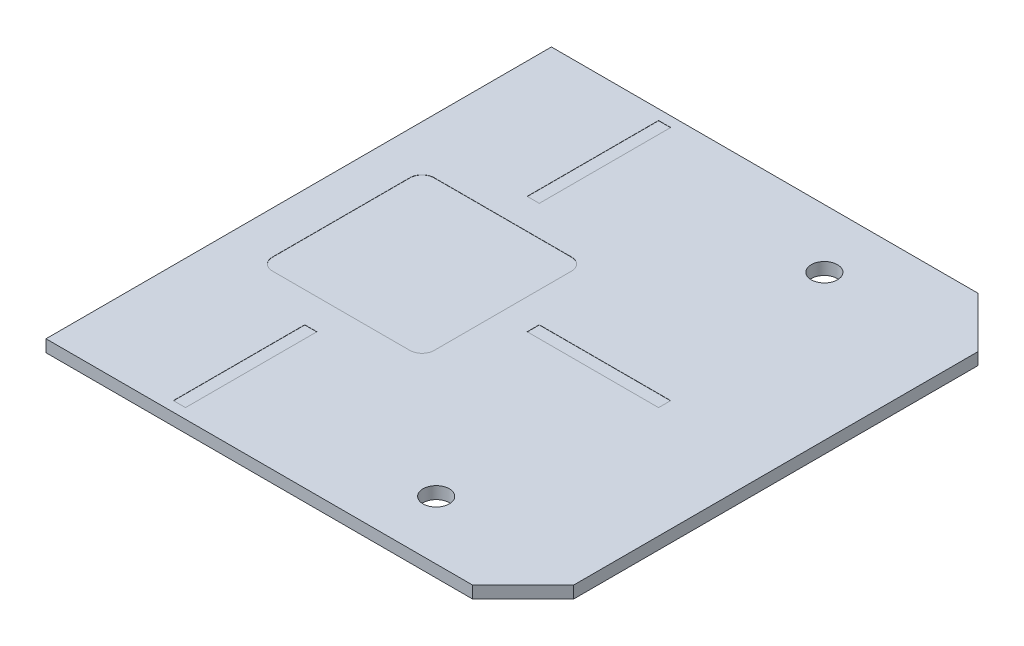
ISO-10303-21;
HEADER;
FILE_DESCRIPTION(('STEP AP214'),'2;1');
FILE_NAME('part.step','',(''),(''),'','','');
FILE_SCHEMA(('AUTOMOTIVE_DESIGN { 1 0 10303 214 1 1 1 1 }'));
ENDSEC;
DATA;
#1=APPLICATION_CONTEXT('core data for automotive mechanical design processes');
#2=APPLICATION_PROTOCOL_DEFINITION('international standard','automotive_design',2000,#1);
#3=PRODUCT_CONTEXT('',#1,'mechanical');
#4=PRODUCT('Part','Part','',(#3));
#5=PRODUCT_RELATED_PRODUCT_CATEGORY('part','',(#4));
#6=PRODUCT_DEFINITION_FORMATION('','',#4);
#7=PRODUCT_DEFINITION_CONTEXT('part definition',#1,'design');
#8=PRODUCT_DEFINITION('design','',#6,#7);
#9=PRODUCT_DEFINITION_SHAPE('','',#8);
#10=(LENGTH_UNIT() NAMED_UNIT(*) SI_UNIT(.MILLI.,.METRE.));
#11=(NAMED_UNIT(*) PLANE_ANGLE_UNIT() SI_UNIT($,.RADIAN.));
#12=(NAMED_UNIT(*) SI_UNIT($,.STERADIAN.) SOLID_ANGLE_UNIT());
#13=UNCERTAINTY_MEASURE_WITH_UNIT(LENGTH_MEASURE(1.E-05),#10,'distance_accuracy_value','');
#14=(GEOMETRIC_REPRESENTATION_CONTEXT(3) GLOBAL_UNCERTAINTY_ASSIGNED_CONTEXT((#13)) GLOBAL_UNIT_ASSIGNED_CONTEXT((#10,
#11,#12)) REPRESENTATION_CONTEXT('',''));
#15=CARTESIAN_POINT('',(0.,0.,0.));
#16=DIRECTION('',(0.,0.,1.));
#17=DIRECTION('',(1.,0.,0.));
#18=AXIS2_PLACEMENT_3D('',#15,#16,#17);
#19=CARTESIAN_POINT('',(0.,-4.30000000000049,0.));
#20=DIRECTION('',(0.,-1.,0.));
#21=DIRECTION('',(1.,0.,0.));
#22=AXIS2_PLACEMENT_3D('',#19,#20,#21);
#23=PLANE('',#22);
#24=CARTESIAN_POINT('',(849.000000000043,-4.3000000000004,96.));
#25=DIRECTION('',(0.,-1.,0.));
#26=DIRECTION('',(1.,0.,0.));
#27=AXIS2_PLACEMENT_3D('',#24,#25,#26);
#28=CIRCLE('',#27,6.50000000000002);
#29=CARTESIAN_POINT('',(855.500000000043,-4.3000000000004,96.));
#30=VERTEX_POINT('',#29);
#31=EDGE_CURVE('E399',#30,#30,#28,.T.);
#32=ORIENTED_EDGE('',*,*,#31,.F.);
#33=EDGE_LOOP('',(#32));
#34=FACE_BOUND('',#33,.T.);
#35=DIRECTION('',(1.,0.,0.));
#36=VECTOR('',#35,1.);
#37=CARTESIAN_POINT('',(896.000000000044,-4.3000000000004,-125.));
#38=LINE('',#37,#36);
#39=CARTESIAN_POINT('',(685.000000000044,-4.30000000000042,-125.000000000003));
#40=VERTEX_POINT('',#39);
#41=CARTESIAN_POINT('',(896.000000000044,-4.3000000000004,-125.));
#42=VERTEX_POINT('',#41);
#43=EDGE_CURVE('E405',#40,#42,#38,.T.);
#44=ORIENTED_EDGE('',*,*,#43,.T.);
#45=DIRECTION('',(0.707106781186538,0.,0.707106781186557));
#46=VECTOR('',#45,1.);
#47=CARTESIAN_POINT('',(921.000000000044,-4.3000000000004,-100.));
#48=LINE('',#47,#46);
#49=CARTESIAN_POINT('',(921.000000000044,-4.3000000000004,-100.));
#50=VERTEX_POINT('',#49);
#51=EDGE_CURVE('E408',#42,#50,#48,.T.);
#52=ORIENTED_EDGE('',*,*,#51,.T.);
#53=DIRECTION('',(0.,0.,1.));
#54=VECTOR('',#53,1.);
#55=CARTESIAN_POINT('',(921.000000000044,-4.3000000000004,-100.));
#56=LINE('',#55,#54);
#57=CARTESIAN_POINT('',(921.000000000043,-4.3000000000004,100.));
#58=VERTEX_POINT('',#57);
#59=EDGE_CURVE('E411',#50,#58,#56,.T.);
#60=ORIENTED_EDGE('',*,*,#59,.T.);
#61=DIRECTION('',(-0.707106781186549,0.,0.707106781186546));
#62=VECTOR('',#61,1.);
#63=CARTESIAN_POINT('',(921.000000000043,-4.3000000000004,100.));
#64=LINE('',#63,#62);
#65=CARTESIAN_POINT('',(896.000000000042,-4.3000000000004,125.));
#66=VERTEX_POINT('',#65);
#67=EDGE_CURVE('E413',#58,#66,#64,.T.);
#68=ORIENTED_EDGE('',*,*,#67,.T.);
#69=DIRECTION('',(-1.,0.,0.));
#70=VECTOR('',#69,1.);
#71=CARTESIAN_POINT('',(896.000000000042,-4.3000000000004,125.));
#72=LINE('',#71,#70);
#73=CARTESIAN_POINT('',(685.000000000043,-4.30000000000042,125.));
#74=VERTEX_POINT('',#73);
#75=EDGE_CURVE('E415',#66,#74,#72,.T.);
#76=ORIENTED_EDGE('',*,*,#75,.T.);
#77=DIRECTION('',(0.,0.,-1.));
#78=VECTOR('',#77,1.);
#79=CARTESIAN_POINT('',(685.000000000043,-4.30000000000042,125.));
#80=LINE('',#79,#78);
#81=EDGE_CURVE('E417',#74,#40,#80,.T.);
#82=ORIENTED_EDGE('',*,*,#81,.T.);
#83=EDGE_LOOP('',(#44,#52,#60,#68,#76,#82));
#84=FACE_BOUND('',#83,.T.);
#85=CARTESIAN_POINT('',(849.000000000044,-4.3000000000004,-96.000000000001));
#86=DIRECTION('',(0.,-1.,0.));
#87=DIRECTION('',(-1.,0.,0.));
#88=AXIS2_PLACEMENT_3D('',#85,#86,#87);
#89=CIRCLE('',#88,6.5);
#90=CARTESIAN_POINT('',(842.500000000044,-4.3000000000004,-96.000000000001));
#91=VERTEX_POINT('',#90);
#92=EDGE_CURVE('E393',#91,#91,#89,.T.);
#93=ORIENTED_EDGE('',*,*,#92,.F.);
#94=EDGE_LOOP('',(#93));
#95=FACE_BOUND('',#94,.T.);
#96=ADVANCED_FACE('F55',(#34,#84,#95),#23,.T.);
#97=CARTESIAN_POINT('',(0.,1.69999999999951,0.));
#98=DIRECTION('',(0.,-1.,0.));
#99=DIRECTION('',(1.,0.,0.));
#100=AXIS2_PLACEMENT_3D('',#97,#98,#99);
#101=PLANE('',#100);
#102=DIRECTION('',(-1.,0.,0.));
#103=VECTOR('',#102,1.);
#104=CARTESIAN_POINT('',(712.,1.69999999999958,-40.));
#105=LINE('',#104,#103);
#106=CARTESIAN_POINT('',(780.,1.69999999999959,-40.));
#107=VERTEX_POINT('',#106);
#108=CARTESIAN_POINT('',(712.,1.69999999999958,-40.));
#109=VERTEX_POINT('',#108);
#110=EDGE_CURVE('E269',#107,#109,#105,.T.);
#111=ORIENTED_EDGE('',*,*,#110,.F.);
#112=CARTESIAN_POINT('',(780.,1.69999999999959,-34.));
#113=DIRECTION('',(0.,1.,0.));
#114=DIRECTION('',(1.,0.,0.));
#115=AXIS2_PLACEMENT_3D('',#112,#113,#114);
#116=CIRCLE('',#115,6.);
#117=CARTESIAN_POINT('',(786.,1.69999999999959,-34.));
#118=VERTEX_POINT('',#117);
#119=EDGE_CURVE('E70',#118,#107,#116,.T.);
#120=ORIENTED_EDGE('',*,*,#119,.F.);
#121=DIRECTION('',(0.,0.,-1.));
#122=VECTOR('',#121,1.);
#123=CARTESIAN_POINT('',(786.,1.69999999999959,-34.));
#124=LINE('',#123,#122);
#125=CARTESIAN_POINT('',(786.,1.69999999999959,34.0000000000001));
#126=VERTEX_POINT('',#125);
#127=EDGE_CURVE('E249',#126,#118,#124,.T.);
#128=ORIENTED_EDGE('',*,*,#127,.F.);
#129=CARTESIAN_POINT('',(780.,1.69999999999959,34.0000000000002));
#130=DIRECTION('',(0.,1.,0.));
#131=DIRECTION('',(-1.,0.,0.));
#132=AXIS2_PLACEMENT_3D('',#129,#130,#131);
#133=CIRCLE('',#132,6.);
#134=CARTESIAN_POINT('',(780.,1.69999999999959,40.0000000000002));
#135=VERTEX_POINT('',#134);
#136=EDGE_CURVE('E252',#135,#126,#133,.T.);
#137=ORIENTED_EDGE('',*,*,#136,.F.);
#138=DIRECTION('',(1.,0.,0.));
#139=VECTOR('',#138,1.);
#140=CARTESIAN_POINT('',(712.,1.69999999999958,40.0000000000002));
#141=LINE('',#140,#139);
#142=CARTESIAN_POINT('',(712.,1.69999999999958,40.0000000000002));
#143=VERTEX_POINT('',#142);
#144=EDGE_CURVE('E280',#143,#135,#141,.T.);
#145=ORIENTED_EDGE('',*,*,#144,.F.);
#146=CARTESIAN_POINT('',(712.,1.69999999999958,34.0000000000002));
#147=DIRECTION('',(0.,1.,0.));
#148=DIRECTION('',(-1.,0.,0.));
#149=AXIS2_PLACEMENT_3D('',#146,#147,#148);
#150=CIRCLE('',#149,6.);
#151=CARTESIAN_POINT('',(706.,1.69999999999958,34.0000000000001));
#152=VERTEX_POINT('',#151);
#153=EDGE_CURVE('E277',#152,#143,#150,.T.);
#154=ORIENTED_EDGE('',*,*,#153,.F.);
#155=DIRECTION('',(0.,0.,1.));
#156=VECTOR('',#155,1.);
#157=CARTESIAN_POINT('',(706.,1.69999999999958,-34.));
#158=LINE('',#157,#156);
#159=CARTESIAN_POINT('',(706.,1.69999999999958,-34.));
#160=VERTEX_POINT('',#159);
#161=EDGE_CURVE('E274',#160,#152,#158,.T.);
#162=ORIENTED_EDGE('',*,*,#161,.F.);
#163=CARTESIAN_POINT('',(712.,1.69999999999958,-34.));
#164=DIRECTION('',(0.,1.,0.));
#165=DIRECTION('',(-1.,0.,0.));
#166=AXIS2_PLACEMENT_3D('',#163,#164,#165);
#167=CIRCLE('',#166,6.);
#168=EDGE_CURVE('E271',#109,#160,#167,.T.);
#169=ORIENTED_EDGE('',*,*,#168,.F.);
#170=EDGE_LOOP('',(#111,#120,#128,#137,#145,#154,#162,#169));
#171=FACE_BOUND('',#170,.T.);
#172=DIRECTION('',(1.,0.,0.));
#173=VECTOR('',#172,1.);
#174=CARTESIAN_POINT('',(743.,1.69999999999959,120.));
#175=LINE('',#174,#173);
#176=CARTESIAN_POINT('',(743.,1.69999999999959,120.));
#177=VERTEX_POINT('',#176);
#178=CARTESIAN_POINT('',(749.,1.69999999999959,120.));
#179=VERTEX_POINT('',#178);
#180=EDGE_CURVE('E313',#177,#179,#175,.T.);
#181=ORIENTED_EDGE('',*,*,#180,.F.);
#182=DIRECTION('',(0.,0.,1.));
#183=VECTOR('',#182,1.);
#184=CARTESIAN_POINT('',(743.,1.69999999999959,55.));
#185=LINE('',#184,#183);
#186=CARTESIAN_POINT('',(743.,1.69999999999959,55.));
#187=VERTEX_POINT('',#186);
#188=EDGE_CURVE('E78',#187,#177,#185,.T.);
#189=ORIENTED_EDGE('',*,*,#188,.F.);
#190=DIRECTION('',(-1.,0.,0.));
#191=VECTOR('',#190,1.);
#192=CARTESIAN_POINT('',(743.,1.69999999999959,55.));
#193=LINE('',#192,#191);
#194=CARTESIAN_POINT('',(749.,1.69999999999959,55.));
#195=VERTEX_POINT('',#194);
#196=EDGE_CURVE('E302',#195,#187,#193,.T.);
#197=ORIENTED_EDGE('',*,*,#196,.F.);
#198=DIRECTION('',(0.,0.,-1.));
#199=VECTOR('',#198,1.);
#200=CARTESIAN_POINT('',(749.,1.69999999999959,55.));
#201=LINE('',#200,#199);
#202=EDGE_CURVE('E316',#179,#195,#201,.T.);
#203=ORIENTED_EDGE('',*,*,#202,.F.);
#204=EDGE_LOOP('',(#181,#189,#197,#203));
#205=FACE_BOUND('',#204,.T.);
#206=DIRECTION('',(1.,0.,0.));
#207=VECTOR('',#206,1.);
#208=CARTESIAN_POINT('',(801.,1.69999999999959,3.));
#209=LINE('',#208,#207);
#210=CARTESIAN_POINT('',(801.,1.69999999999959,3.));
#211=VERTEX_POINT('',#210);
#212=CARTESIAN_POINT('',(866.,1.6999999999996,3.));
#213=VERTEX_POINT('',#212);
#214=EDGE_CURVE('E344',#211,#213,#209,.T.);
#215=ORIENTED_EDGE('',*,*,#214,.F.);
#216=DIRECTION('',(0.,0.,1.));
#217=VECTOR('',#216,1.);
#218=CARTESIAN_POINT('',(801.,1.69999999999959,-3.));
#219=LINE('',#218,#217);
#220=CARTESIAN_POINT('',(801.,1.69999999999959,-3.));
#221=VERTEX_POINT('',#220);
#222=EDGE_CURVE('E323',#221,#211,#219,.T.);
#223=ORIENTED_EDGE('',*,*,#222,.F.);
#224=DIRECTION('',(-1.,0.,0.));
#225=VECTOR('',#224,1.);
#226=CARTESIAN_POINT('',(801.,1.69999999999959,-3.));
#227=LINE('',#226,#225);
#228=CARTESIAN_POINT('',(866.,1.6999999999996,-3.));
#229=VERTEX_POINT('',#228);
#230=EDGE_CURVE('E333',#229,#221,#227,.T.);
#231=ORIENTED_EDGE('',*,*,#230,.F.);
#232=DIRECTION('',(0.,0.,-1.));
#233=VECTOR('',#232,1.);
#234=CARTESIAN_POINT('',(866.,1.6999999999996,-3.));
#235=LINE('',#234,#233);
#236=EDGE_CURVE('E347',#213,#229,#235,.T.);
#237=ORIENTED_EDGE('',*,*,#236,.F.);
#238=EDGE_LOOP('',(#215,#223,#231,#237));
#239=FACE_BOUND('',#238,.T.);
#240=DIRECTION('',(1.,0.,0.));
#241=VECTOR('',#240,1.);
#242=CARTESIAN_POINT('',(743.000000000002,1.69999999999959,-55.));
#243=LINE('',#242,#241);
#244=CARTESIAN_POINT('',(743.000000000002,1.69999999999959,-55.));
#245=VERTEX_POINT('',#244);
#246=CARTESIAN_POINT('',(749.000000000001,1.69999999999959,-55.));
#247=VERTEX_POINT('',#246);
#248=EDGE_CURVE('E376',#245,#247,#243,.T.);
#249=ORIENTED_EDGE('',*,*,#248,.F.);
#250=DIRECTION('',(0.,0.,1.));
#251=VECTOR('',#250,1.);
#252=CARTESIAN_POINT('',(743.000000000002,1.69999999999959,-120.));
#253=LINE('',#252,#251);
#254=CARTESIAN_POINT('',(743.000000000002,1.69999999999959,-120.));
#255=VERTEX_POINT('',#254);
#256=EDGE_CURVE('E354',#255,#245,#253,.T.);
#257=ORIENTED_EDGE('',*,*,#256,.F.);
#258=DIRECTION('',(-1.,0.,0.));
#259=VECTOR('',#258,1.);
#260=CARTESIAN_POINT('',(743.000000000002,1.69999999999959,-120.));
#261=LINE('',#260,#259);
#262=CARTESIAN_POINT('',(749.000000000001,1.69999999999959,-120.));
#263=VERTEX_POINT('',#262);
#264=EDGE_CURVE('E365',#263,#255,#261,.T.);
#265=ORIENTED_EDGE('',*,*,#264,.F.);
#266=DIRECTION('',(0.,0.,-1.));
#267=VECTOR('',#266,1.);
#268=CARTESIAN_POINT('',(749.000000000001,1.69999999999959,-120.));
#269=LINE('',#268,#267);
#270=EDGE_CURVE('E379',#247,#263,#269,.T.);
#271=ORIENTED_EDGE('',*,*,#270,.F.);
#272=EDGE_LOOP('',(#249,#257,#265,#271));
#273=FACE_BOUND('',#272,.T.);
#274=DIRECTION('',(1.,0.,0.));
#275=VECTOR('',#274,1.);
#276=CARTESIAN_POINT('',(896.000000000044,1.6999999999996,-125.));
#277=LINE('',#276,#275);
#278=CARTESIAN_POINT('',(685.000000000044,1.69999999999958,-125.000000000003));
#279=VERTEX_POINT('',#278);
#280=CARTESIAN_POINT('',(896.000000000044,1.6999999999996,-125.));
#281=VERTEX_POINT('',#280);
#282=EDGE_CURVE('E402',#279,#281,#277,.T.);
#283=ORIENTED_EDGE('',*,*,#282,.F.);
#284=DIRECTION('',(0.,0.,-1.));
#285=VECTOR('',#284,1.);
#286=CARTESIAN_POINT('',(685.000000000043,1.69999999999958,125.));
#287=LINE('',#286,#285);
#288=CARTESIAN_POINT('',(685.000000000043,1.69999999999958,125.));
#289=VERTEX_POINT('',#288);
#290=EDGE_CURVE('E409',#289,#279,#287,.T.);
#291=ORIENTED_EDGE('',*,*,#290,.F.);
#292=DIRECTION('',(-1.,0.,0.));
#293=VECTOR('',#292,1.);
#294=CARTESIAN_POINT('',(896.000000000042,1.6999999999996,125.));
#295=LINE('',#294,#293);
#296=CARTESIAN_POINT('',(896.000000000042,1.6999999999996,125.));
#297=VERTEX_POINT('',#296);
#298=EDGE_CURVE('E428',#297,#289,#295,.T.);
#299=ORIENTED_EDGE('',*,*,#298,.F.);
#300=DIRECTION('',(-0.707106781186549,0.,0.707106781186546));
#301=VECTOR('',#300,1.);
#302=CARTESIAN_POINT('',(921.000000000043,1.69999999999961,100.));
#303=LINE('',#302,#301);
#304=CARTESIAN_POINT('',(921.000000000043,1.69999999999961,100.));
#305=VERTEX_POINT('',#304);
#306=EDGE_CURVE('E426',#305,#297,#303,.T.);
#307=ORIENTED_EDGE('',*,*,#306,.F.);
#308=DIRECTION('',(0.,0.,1.));
#309=VECTOR('',#308,1.);
#310=CARTESIAN_POINT('',(921.000000000044,1.69999999999961,-100.));
#311=LINE('',#310,#309);
#312=CARTESIAN_POINT('',(921.000000000044,1.69999999999961,-100.));
#313=VERTEX_POINT('',#312);
#314=EDGE_CURVE('E424',#313,#305,#311,.T.);
#315=ORIENTED_EDGE('',*,*,#314,.F.);
#316=DIRECTION('',(0.707106781186538,0.,0.707106781186557));
#317=VECTOR('',#316,1.);
#318=CARTESIAN_POINT('',(921.000000000044,1.69999999999961,-100.));
#319=LINE('',#318,#317);
#320=EDGE_CURVE('E422',#281,#313,#319,.T.);
#321=ORIENTED_EDGE('',*,*,#320,.F.);
#322=EDGE_LOOP('',(#283,#291,#299,#307,#315,#321));
#323=FACE_BOUND('',#322,.T.);
#324=CARTESIAN_POINT('',(849.000000000043,1.6999999999996,96.));
#325=DIRECTION('',(0.,-1.,0.));
#326=DIRECTION('',(1.,0.,0.));
#327=AXIS2_PLACEMENT_3D('',#324,#325,#326);
#328=CIRCLE('',#327,6.50000000000002);
#329=CARTESIAN_POINT('',(855.500000000043,1.6999999999996,96.));
#330=VERTEX_POINT('',#329);
#331=EDGE_CURVE('E396',#330,#330,#328,.T.);
#332=ORIENTED_EDGE('',*,*,#331,.T.);
#333=EDGE_LOOP('',(#332));
#334=FACE_BOUND('',#333,.T.);
#335=CARTESIAN_POINT('',(849.000000000044,1.6999999999996,-96.000000000001));
#336=DIRECTION('',(0.,-1.,0.));
#337=DIRECTION('',(-1.,0.,0.));
#338=AXIS2_PLACEMENT_3D('',#335,#336,#337);
#339=CIRCLE('',#338,6.5);
#340=CARTESIAN_POINT('',(842.500000000044,1.6999999999996,-96.000000000001));
#341=VERTEX_POINT('',#340);
#342=EDGE_CURVE('E386',#341,#341,#339,.T.);
#343=ORIENTED_EDGE('',*,*,#342,.T.);
#344=EDGE_LOOP('',(#343));
#345=FACE_BOUND('',#344,.T.);
#346=ADVANCED_FACE('F452',(#171,#205,#239,#273,#323,#334,#345),#101,.F.);
#347=CARTESIAN_POINT('',(896.000000000044,-4.3000000000004,-125.));
#348=DIRECTION('',(0.,0.,1.));
#349=DIRECTION('',(1.,0.,0.));
#350=AXIS2_PLACEMENT_3D('',#347,#348,#349);
#351=PLANE('',#350);
#352=ORIENTED_EDGE('',*,*,#282,.T.);
#353=DIRECTION('',(0.,1.,0.));
#354=VECTOR('',#353,1.);
#355=CARTESIAN_POINT('',(896.000000000044,-4.3000000000004,-125.));
#356=LINE('',#355,#354);
#357=EDGE_CURVE('E13',#42,#281,#356,.T.);
#358=ORIENTED_EDGE('',*,*,#357,.F.);
#359=ORIENTED_EDGE('',*,*,#43,.F.);
#360=DIRECTION('',(0.,1.,0.));
#361=VECTOR('',#360,1.);
#362=CARTESIAN_POINT('',(685.000000000044,-4.30000000000042,-125.000000000003));
#363=LINE('',#362,#361);
#364=EDGE_CURVE('E419',#40,#279,#363,.T.);
#365=ORIENTED_EDGE('',*,*,#364,.T.);
#366=EDGE_LOOP('',(#352,#358,#359,#365));
#367=FACE_BOUND('',#366,.T.);
#368=ADVANCED_FACE('F57',(#367),#351,.F.);
#369=CARTESIAN_POINT('',(921.000000000044,-4.3000000000004,-100.));
#370=DIRECTION('',(-0.707106781186557,0.,0.707106781186538));
#371=DIRECTION('',(0.707106781186538,0.,0.707106781186557));
#372=AXIS2_PLACEMENT_3D('',#369,#370,#371);
#373=PLANE('',#372);
#374=ORIENTED_EDGE('',*,*,#320,.T.);
#375=DIRECTION('',(0.,1.,0.));
#376=VECTOR('',#375,1.);
#377=CARTESIAN_POINT('',(921.000000000044,-4.3000000000004,-100.));
#378=LINE('',#377,#376);
#379=EDGE_CURVE('E63',#50,#313,#378,.T.);
#380=ORIENTED_EDGE('',*,*,#379,.F.);
#381=ORIENTED_EDGE('',*,*,#51,.F.);
#382=ORIENTED_EDGE('',*,*,#357,.T.);
#383=EDGE_LOOP('',(#374,#380,#381,#382));
#384=FACE_BOUND('',#383,.T.);
#385=ADVANCED_FACE('F470',(#384),#373,.F.);
#386=CARTESIAN_POINT('',(921.000000000044,-4.3000000000004,-100.));
#387=DIRECTION('',(-1.,0.,0.));
#388=DIRECTION('',(0.,0.,1.));
#389=AXIS2_PLACEMENT_3D('',#386,#387,#388);
#390=PLANE('',#389);
#391=ORIENTED_EDGE('',*,*,#314,.T.);
#392=DIRECTION('',(0.,1.,0.));
#393=VECTOR('',#392,1.);
#394=CARTESIAN_POINT('',(921.000000000043,-4.3000000000004,100.));
#395=LINE('',#394,#393);
#396=EDGE_CURVE('E439',#58,#305,#395,.T.);
#397=ORIENTED_EDGE('',*,*,#396,.F.);
#398=ORIENTED_EDGE('',*,*,#59,.F.);
#399=ORIENTED_EDGE('',*,*,#379,.T.);
#400=EDGE_LOOP('',(#391,#397,#398,#399));
#401=FACE_BOUND('',#400,.T.);
#402=ADVANCED_FACE('F446',(#401),#390,.F.);
#403=CARTESIAN_POINT('',(921.000000000043,-4.3000000000004,100.));
#404=DIRECTION('',(-0.707106781186545,0.,-0.707106781186549));
#405=DIRECTION('',(-0.707106781186549,0.,0.707106781186546));
#406=AXIS2_PLACEMENT_3D('',#403,#404,#405);
#407=PLANE('',#406);
#408=ORIENTED_EDGE('',*,*,#306,.T.);
#409=DIRECTION('',(0.,1.,0.));
#410=VECTOR('',#409,1.);
#411=CARTESIAN_POINT('',(896.000000000042,-4.3000000000004,125.));
#412=LINE('',#411,#410);
#413=EDGE_CURVE('E436',#66,#297,#412,.T.);
#414=ORIENTED_EDGE('',*,*,#413,.F.);
#415=ORIENTED_EDGE('',*,*,#67,.F.);
#416=ORIENTED_EDGE('',*,*,#396,.T.);
#417=EDGE_LOOP('',(#408,#414,#415,#416));
#418=FACE_BOUND('',#417,.T.);
#419=ADVANCED_FACE('F458',(#418),#407,.F.);
#420=CARTESIAN_POINT('',(896.000000000042,-4.3000000000004,125.));
#421=DIRECTION('',(0.,0.,-1.));
#422=DIRECTION('',(-1.,0.,0.));
#423=AXIS2_PLACEMENT_3D('',#420,#421,#422);
#424=PLANE('',#423);
#425=ORIENTED_EDGE('',*,*,#298,.T.);
#426=DIRECTION('',(0.,1.,0.));
#427=VECTOR('',#426,1.);
#428=CARTESIAN_POINT('',(685.000000000043,-4.30000000000042,125.));
#429=LINE('',#428,#427);
#430=EDGE_CURVE('E433',#74,#289,#429,.T.);
#431=ORIENTED_EDGE('',*,*,#430,.F.);
#432=ORIENTED_EDGE('',*,*,#75,.F.);
#433=ORIENTED_EDGE('',*,*,#413,.T.);
#434=EDGE_LOOP('',(#425,#431,#432,#433));
#435=FACE_BOUND('',#434,.T.);
#436=ADVANCED_FACE('F462',(#435),#424,.F.);
#437=CARTESIAN_POINT('',(685.000000000043,-4.30000000000042,125.));
#438=DIRECTION('',(1.,0.,0.));
#439=DIRECTION('',(0.,0.,-1.));
#440=AXIS2_PLACEMENT_3D('',#437,#438,#439);
#441=PLANE('',#440);
#442=ORIENTED_EDGE('',*,*,#290,.T.);
#443=ORIENTED_EDGE('',*,*,#364,.F.);
#444=ORIENTED_EDGE('',*,*,#81,.F.);
#445=ORIENTED_EDGE('',*,*,#430,.T.);
#446=EDGE_LOOP('',(#442,#443,#444,#445));
#447=FACE_BOUND('',#446,.T.);
#448=ADVANCED_FACE('F473',(#447),#441,.F.);
#449=CARTESIAN_POINT('',(849.000000000043,-4.3000000000004,96.));
#450=DIRECTION('',(0.,1.,0.));
#451=DIRECTION('',(-1.,0.,0.));
#452=AXIS2_PLACEMENT_3D('',#449,#450,#451);
#453=CYLINDRICAL_SURFACE('',#452,6.50000000000002);
#454=ORIENTED_EDGE('',*,*,#31,.T.);
#455=EDGE_LOOP('',(#454));
#456=FACE_BOUND('',#455,.T.);
#457=ORIENTED_EDGE('',*,*,#331,.F.);
#458=EDGE_LOOP('',(#457));
#459=FACE_BOUND('',#458,.T.);
#460=ADVANCED_FACE('F475',(#456,#459),#453,.F.);
#461=CARTESIAN_POINT('',(849.000000000044,-4.3000000000004,-96.000000000001));
#462=DIRECTION('',(0.,1.,0.));
#463=DIRECTION('',(-1.,0.,0.));
#464=AXIS2_PLACEMENT_3D('',#461,#462,#463);
#465=CYLINDRICAL_SURFACE('',#464,6.5);
#466=ORIENTED_EDGE('',*,*,#92,.T.);
#467=EDGE_LOOP('',(#466));
#468=FACE_BOUND('',#467,.T.);
#469=ORIENTED_EDGE('',*,*,#342,.F.);
#470=EDGE_LOOP('',(#469));
#471=FACE_BOUND('',#470,.T.);
#472=ADVANCED_FACE('F481',(#468,#471),#465,.F.);
#473=CARTESIAN_POINT('',(743.000000000002,1.59999999999959,-120.));
#474=DIRECTION('',(-1.,0.,0.));
#475=DIRECTION('',(0.,-1.,0.));
#476=AXIS2_PLACEMENT_3D('',#473,#474,#475);
#477=PLANE('',#476);
#478=ORIENTED_EDGE('',*,*,#256,.T.);
#479=DIRECTION('',(0.,1.,0.));
#480=VECTOR('',#479,1.);
#481=CARTESIAN_POINT('',(743.000000000002,1.59999999999959,-55.));
#482=LINE('',#481,#480);
#483=CARTESIAN_POINT('',(743.000000000002,1.59999999999959,-55.));
#484=VERTEX_POINT('',#483);
#485=EDGE_CURVE('E374',#484,#245,#482,.T.);
#486=ORIENTED_EDGE('',*,*,#485,.F.);
#487=DIRECTION('',(0.,0.,1.));
#488=VECTOR('',#487,1.);
#489=CARTESIAN_POINT('',(743.000000000002,1.59999999999959,-120.));
#490=LINE('',#489,#488);
#491=CARTESIAN_POINT('',(743.000000000002,1.59999999999959,-120.));
#492=VERTEX_POINT('',#491);
#493=EDGE_CURVE('E361',#492,#484,#490,.T.);
#494=ORIENTED_EDGE('',*,*,#493,.F.);
#495=DIRECTION('',(0.,1.,0.));
#496=VECTOR('',#495,1.);
#497=CARTESIAN_POINT('',(743.000000000002,1.59999999999959,-120.));
#498=LINE('',#497,#496);
#499=EDGE_CURVE('E384',#492,#255,#498,.T.);
#500=ORIENTED_EDGE('',*,*,#499,.T.);
#501=EDGE_LOOP('',(#478,#486,#494,#500));
#502=FACE_BOUND('',#501,.T.);
#503=ADVANCED_FACE('F497',(#502),#477,.F.);
#504=CARTESIAN_POINT('',(743.000000000002,1.59999999999959,-120.));
#505=DIRECTION('',(0.,0.,-1.));
#506=DIRECTION('',(0.,1.,0.));
#507=AXIS2_PLACEMENT_3D('',#504,#505,#506);
#508=PLANE('',#507);
#509=ORIENTED_EDGE('',*,*,#264,.T.);
#510=ORIENTED_EDGE('',*,*,#499,.F.);
#511=DIRECTION('',(-1.,0.,0.));
#512=VECTOR('',#511,1.);
#513=CARTESIAN_POINT('',(743.000000000002,1.59999999999959,-120.));
#514=LINE('',#513,#512);
#515=CARTESIAN_POINT('',(749.000000000001,1.59999999999959,-120.));
#516=VERTEX_POINT('',#515);
#517=EDGE_CURVE('E371',#516,#492,#514,.T.);
#518=ORIENTED_EDGE('',*,*,#517,.F.);
#519=DIRECTION('',(0.,1.,0.));
#520=VECTOR('',#519,1.);
#521=CARTESIAN_POINT('',(749.000000000001,1.59999999999959,-120.));
#522=LINE('',#521,#520);
#523=EDGE_CURVE('E387',#516,#263,#522,.T.);
#524=ORIENTED_EDGE('',*,*,#523,.T.);
#525=EDGE_LOOP('',(#509,#510,#518,#524));
#526=FACE_BOUND('',#525,.T.);
#527=ADVANCED_FACE('F501',(#526),#508,.F.);
#528=CARTESIAN_POINT('',(749.000000000001,1.59999999999959,-120.));
#529=DIRECTION('',(1.,0.,0.));
#530=DIRECTION('',(0.,1.,0.));
#531=AXIS2_PLACEMENT_3D('',#528,#529,#530);
#532=PLANE('',#531);
#533=ORIENTED_EDGE('',*,*,#270,.T.);
#534=ORIENTED_EDGE('',*,*,#523,.F.);
#535=DIRECTION('',(0.,0.,-1.));
#536=VECTOR('',#535,1.);
#537=CARTESIAN_POINT('',(749.000000000001,1.59999999999959,-120.));
#538=LINE('',#537,#536);
#539=CARTESIAN_POINT('',(749.000000000001,1.59999999999959,-55.));
#540=VERTEX_POINT('',#539);
#541=EDGE_CURVE('E368',#540,#516,#538,.T.);
#542=ORIENTED_EDGE('',*,*,#541,.F.);
#543=DIRECTION('',(0.,1.,0.));
#544=VECTOR('',#543,1.);
#545=CARTESIAN_POINT('',(749.000000000001,1.59999999999959,-55.));
#546=LINE('',#545,#544);
#547=EDGE_CURVE('E389',#540,#247,#546,.T.);
#548=ORIENTED_EDGE('',*,*,#547,.T.);
#549=EDGE_LOOP('',(#533,#534,#542,#548));
#550=FACE_BOUND('',#549,.T.);
#551=ADVANCED_FACE('F507',(#550),#532,.F.);
#552=CARTESIAN_POINT('',(743.000000000002,1.59999999999959,-55.));
#553=DIRECTION('',(0.,0.,1.));
#554=DIRECTION('',(0.,-1.,0.));
#555=AXIS2_PLACEMENT_3D('',#552,#553,#554);
#556=PLANE('',#555);
#557=ORIENTED_EDGE('',*,*,#248,.T.);
#558=ORIENTED_EDGE('',*,*,#547,.F.);
#559=DIRECTION('',(1.,0.,0.));
#560=VECTOR('',#559,1.);
#561=CARTESIAN_POINT('',(743.000000000002,1.59999999999959,-55.));
#562=LINE('',#561,#560);
#563=EDGE_CURVE('E364',#484,#540,#562,.T.);
#564=ORIENTED_EDGE('',*,*,#563,.F.);
#565=ORIENTED_EDGE('',*,*,#485,.T.);
#566=EDGE_LOOP('',(#557,#558,#564,#565));
#567=FACE_BOUND('',#566,.T.);
#568=ADVANCED_FACE('F503',(#567),#556,.F.);
#569=CARTESIAN_POINT('',(0.,1.59999999999951,0.));
#570=DIRECTION('',(0.,1.,0.));
#571=DIRECTION('',(-1.,0.,0.));
#572=AXIS2_PLACEMENT_3D('',#569,#570,#571);
#573=PLANE('',#572);
#574=ORIENTED_EDGE('',*,*,#493,.T.);
#575=ORIENTED_EDGE('',*,*,#563,.T.);
#576=ORIENTED_EDGE('',*,*,#541,.T.);
#577=ORIENTED_EDGE('',*,*,#517,.T.);
#578=EDGE_LOOP('',(#574,#575,#576,#577));
#579=FACE_BOUND('',#578,.T.);
#580=ADVANCED_FACE('F506',(#579),#573,.T.);
#581=CARTESIAN_POINT('',(801.,1.59999999999959,-3.));
#582=DIRECTION('',(-1.,0.,0.));
#583=DIRECTION('',(0.,-1.,0.));
#584=AXIS2_PLACEMENT_3D('',#581,#582,#583);
#585=PLANE('',#584);
#586=ORIENTED_EDGE('',*,*,#222,.T.);
#587=DIRECTION('',(0.,1.,0.));
#588=VECTOR('',#587,1.);
#589=CARTESIAN_POINT('',(801.,1.59999999999959,3.));
#590=LINE('',#589,#588);
#591=CARTESIAN_POINT('',(801.,1.59999999999959,3.));
#592=VERTEX_POINT('',#591);
#593=EDGE_CURVE('E342',#592,#211,#590,.T.);
#594=ORIENTED_EDGE('',*,*,#593,.F.);
#595=DIRECTION('',(0.,0.,1.));
#596=VECTOR('',#595,1.);
#597=CARTESIAN_POINT('',(801.,1.59999999999959,-3.));
#598=LINE('',#597,#596);
#599=CARTESIAN_POINT('',(801.,1.59999999999959,-3.));
#600=VERTEX_POINT('',#599);
#601=EDGE_CURVE('E329',#600,#592,#598,.T.);
#602=ORIENTED_EDGE('',*,*,#601,.F.);
#603=DIRECTION('',(0.,1.,0.));
#604=VECTOR('',#603,1.);
#605=CARTESIAN_POINT('',(801.,1.59999999999959,-3.));
#606=LINE('',#605,#604);
#607=EDGE_CURVE('E352',#600,#221,#606,.T.);
#608=ORIENTED_EDGE('',*,*,#607,.T.);
#609=EDGE_LOOP('',(#586,#594,#602,#608));
#610=FACE_BOUND('',#609,.T.);
#611=ADVANCED_FACE('F517',(#610),#585,.F.);
#612=CARTESIAN_POINT('',(801.,1.59999999999959,-3.));
#613=DIRECTION('',(0.,0.,-1.));
#614=DIRECTION('',(0.,1.,0.));
#615=AXIS2_PLACEMENT_3D('',#612,#613,#614);
#616=PLANE('',#615);
#617=ORIENTED_EDGE('',*,*,#230,.T.);
#618=ORIENTED_EDGE('',*,*,#607,.F.);
#619=DIRECTION('',(-1.,0.,0.));
#620=VECTOR('',#619,1.);
#621=CARTESIAN_POINT('',(801.,1.59999999999959,-3.));
#622=LINE('',#621,#620);
#623=CARTESIAN_POINT('',(866.,1.5999999999996,-3.));
#624=VERTEX_POINT('',#623);
#625=EDGE_CURVE('E339',#624,#600,#622,.T.);
#626=ORIENTED_EDGE('',*,*,#625,.F.);
#627=DIRECTION('',(0.,1.,0.));
#628=VECTOR('',#627,1.);
#629=CARTESIAN_POINT('',(866.,1.5999999999996,-3.));
#630=LINE('',#629,#628);
#631=EDGE_CURVE('E355',#624,#229,#630,.T.);
#632=ORIENTED_EDGE('',*,*,#631,.T.);
#633=EDGE_LOOP('',(#617,#618,#626,#632));
#634=FACE_BOUND('',#633,.T.);
#635=ADVANCED_FACE('F521',(#634),#616,.F.);
#636=CARTESIAN_POINT('',(866.,1.5999999999996,-3.));
#637=DIRECTION('',(1.,0.,0.));
#638=DIRECTION('',(0.,1.,0.));
#639=AXIS2_PLACEMENT_3D('',#636,#637,#638);
#640=PLANE('',#639);
#641=ORIENTED_EDGE('',*,*,#236,.T.);
#642=ORIENTED_EDGE('',*,*,#631,.F.);
#643=DIRECTION('',(0.,0.,-1.));
#644=VECTOR('',#643,1.);
#645=CARTESIAN_POINT('',(866.,1.5999999999996,-3.));
#646=LINE('',#645,#644);
#647=CARTESIAN_POINT('',(866.,1.5999999999996,3.));
#648=VERTEX_POINT('',#647);
#649=EDGE_CURVE('E336',#648,#624,#646,.T.);
#650=ORIENTED_EDGE('',*,*,#649,.F.);
#651=DIRECTION('',(0.,1.,0.));
#652=VECTOR('',#651,1.);
#653=CARTESIAN_POINT('',(866.,1.5999999999996,3.));
#654=LINE('',#653,#652);
#655=EDGE_CURVE('E357',#648,#213,#654,.T.);
#656=ORIENTED_EDGE('',*,*,#655,.T.);
#657=EDGE_LOOP('',(#641,#642,#650,#656));
#658=FACE_BOUND('',#657,.T.);
#659=ADVANCED_FACE('F527',(#658),#640,.F.);
#660=CARTESIAN_POINT('',(801.,1.59999999999959,3.));
#661=DIRECTION('',(0.,0.,1.));
#662=DIRECTION('',(0.,-1.,0.));
#663=AXIS2_PLACEMENT_3D('',#660,#661,#662);
#664=PLANE('',#663);
#665=ORIENTED_EDGE('',*,*,#214,.T.);
#666=ORIENTED_EDGE('',*,*,#655,.F.);
#667=DIRECTION('',(1.,0.,0.));
#668=VECTOR('',#667,1.);
#669=CARTESIAN_POINT('',(801.,1.59999999999959,3.));
#670=LINE('',#669,#668);
#671=EDGE_CURVE('E332',#592,#648,#670,.T.);
#672=ORIENTED_EDGE('',*,*,#671,.F.);
#673=ORIENTED_EDGE('',*,*,#593,.T.);
#674=EDGE_LOOP('',(#665,#666,#672,#673));
#675=FACE_BOUND('',#674,.T.);
#676=ADVANCED_FACE('F523',(#675),#664,.F.);
#677=CARTESIAN_POINT('',(0.,1.59999999999951,0.));
#678=DIRECTION('',(0.,1.,0.));
#679=DIRECTION('',(-1.,0.,0.));
#680=AXIS2_PLACEMENT_3D('',#677,#678,#679);
#681=PLANE('',#680);
#682=ORIENTED_EDGE('',*,*,#601,.T.);
#683=ORIENTED_EDGE('',*,*,#671,.T.);
#684=ORIENTED_EDGE('',*,*,#649,.T.);
#685=ORIENTED_EDGE('',*,*,#625,.T.);
#686=EDGE_LOOP('',(#682,#683,#684,#685));
#687=FACE_BOUND('',#686,.T.);
#688=ADVANCED_FACE('F526',(#687),#681,.T.);
#689=CARTESIAN_POINT('',(743.,1.59999999999959,55.));
#690=DIRECTION('',(-1.,0.,0.));
#691=DIRECTION('',(0.,-1.,0.));
#692=AXIS2_PLACEMENT_3D('',#689,#690,#691);
#693=PLANE('',#692);
#694=ORIENTED_EDGE('',*,*,#188,.T.);
#695=DIRECTION('',(0.,1.,0.));
#696=VECTOR('',#695,1.);
#697=CARTESIAN_POINT('',(743.,1.59999999999959,120.));
#698=LINE('',#697,#696);
#699=CARTESIAN_POINT('',(743.,1.59999999999959,120.));
#700=VERTEX_POINT('',#699);
#701=EDGE_CURVE('E311',#700,#177,#698,.T.);
#702=ORIENTED_EDGE('',*,*,#701,.F.);
#703=DIRECTION('',(0.,0.,1.));
#704=VECTOR('',#703,1.);
#705=CARTESIAN_POINT('',(743.,1.59999999999959,55.));
#706=LINE('',#705,#704);
#707=CARTESIAN_POINT('',(743.,1.59999999999959,55.));
#708=VERTEX_POINT('',#707);
#709=EDGE_CURVE('E298',#708,#700,#706,.T.);
#710=ORIENTED_EDGE('',*,*,#709,.F.);
#711=DIRECTION('',(0.,1.,0.));
#712=VECTOR('',#711,1.);
#713=CARTESIAN_POINT('',(743.,1.59999999999959,55.));
#714=LINE('',#713,#712);
#715=EDGE_CURVE('E321',#708,#187,#714,.T.);
#716=ORIENTED_EDGE('',*,*,#715,.T.);
#717=EDGE_LOOP('',(#694,#702,#710,#716));
#718=FACE_BOUND('',#717,.T.);
#719=ADVANCED_FACE('F537',(#718),#693,.F.);
#720=CARTESIAN_POINT('',(743.,1.59999999999959,55.));
#721=DIRECTION('',(0.,0.,-1.));
#722=DIRECTION('',(0.,1.,0.));
#723=AXIS2_PLACEMENT_3D('',#720,#721,#722);
#724=PLANE('',#723);
#725=ORIENTED_EDGE('',*,*,#196,.T.);
#726=ORIENTED_EDGE('',*,*,#715,.F.);
#727=DIRECTION('',(-1.,0.,0.));
#728=VECTOR('',#727,1.);
#729=CARTESIAN_POINT('',(743.,1.59999999999959,55.));
#730=LINE('',#729,#728);
#731=CARTESIAN_POINT('',(749.,1.59999999999959,55.));
#732=VERTEX_POINT('',#731);
#733=EDGE_CURVE('E308',#732,#708,#730,.T.);
#734=ORIENTED_EDGE('',*,*,#733,.F.);
#735=DIRECTION('',(0.,1.,0.));
#736=VECTOR('',#735,1.);
#737=CARTESIAN_POINT('',(749.,1.59999999999959,55.));
#738=LINE('',#737,#736);
#739=EDGE_CURVE('E324',#732,#195,#738,.T.);
#740=ORIENTED_EDGE('',*,*,#739,.T.);
#741=EDGE_LOOP('',(#725,#726,#734,#740));
#742=FACE_BOUND('',#741,.T.);
#743=ADVANCED_FACE('F541',(#742),#724,.F.);
#744=CARTESIAN_POINT('',(749.,1.59999999999959,55.));
#745=DIRECTION('',(1.,0.,0.));
#746=DIRECTION('',(0.,1.,0.));
#747=AXIS2_PLACEMENT_3D('',#744,#745,#746);
#748=PLANE('',#747);
#749=ORIENTED_EDGE('',*,*,#202,.T.);
#750=ORIENTED_EDGE('',*,*,#739,.F.);
#751=DIRECTION('',(0.,0.,-1.));
#752=VECTOR('',#751,1.);
#753=CARTESIAN_POINT('',(749.,1.59999999999959,55.));
#754=LINE('',#753,#752);
#755=CARTESIAN_POINT('',(749.,1.59999999999959,120.));
#756=VERTEX_POINT('',#755);
#757=EDGE_CURVE('E305',#756,#732,#754,.T.);
#758=ORIENTED_EDGE('',*,*,#757,.F.);
#759=DIRECTION('',(0.,1.,0.));
#760=VECTOR('',#759,1.);
#761=CARTESIAN_POINT('',(749.,1.59999999999959,120.));
#762=LINE('',#761,#760);
#763=EDGE_CURVE('E326',#756,#179,#762,.T.);
#764=ORIENTED_EDGE('',*,*,#763,.T.);
#765=EDGE_LOOP('',(#749,#750,#758,#764));
#766=FACE_BOUND('',#765,.T.);
#767=ADVANCED_FACE('F546',(#766),#748,.F.);
#768=CARTESIAN_POINT('',(743.,1.59999999999959,120.));
#769=DIRECTION('',(0.,0.,1.));
#770=DIRECTION('',(0.,-1.,0.));
#771=AXIS2_PLACEMENT_3D('',#768,#769,#770);
#772=PLANE('',#771);
#773=ORIENTED_EDGE('',*,*,#180,.T.);
#774=ORIENTED_EDGE('',*,*,#763,.F.);
#775=DIRECTION('',(1.,0.,0.));
#776=VECTOR('',#775,1.);
#777=CARTESIAN_POINT('',(743.,1.59999999999959,120.));
#778=LINE('',#777,#776);
#779=EDGE_CURVE('E301',#700,#756,#778,.T.);
#780=ORIENTED_EDGE('',*,*,#779,.F.);
#781=ORIENTED_EDGE('',*,*,#701,.T.);
#782=EDGE_LOOP('',(#773,#774,#780,#781));
#783=FACE_BOUND('',#782,.T.);
#784=ADVANCED_FACE('F542',(#783),#772,.F.);
#785=CARTESIAN_POINT('',(0.,1.59999999999951,0.));
#786=DIRECTION('',(0.,1.,0.));
#787=DIRECTION('',(-1.,0.,0.));
#788=AXIS2_PLACEMENT_3D('',#785,#786,#787);
#789=PLANE('',#788);
#790=ORIENTED_EDGE('',*,*,#709,.T.);
#791=ORIENTED_EDGE('',*,*,#779,.T.);
#792=ORIENTED_EDGE('',*,*,#757,.T.);
#793=ORIENTED_EDGE('',*,*,#733,.T.);
#794=EDGE_LOOP('',(#790,#791,#792,#793));
#795=FACE_BOUND('',#794,.T.);
#796=ADVANCED_FACE('F545',(#795),#789,.T.);
#797=CARTESIAN_POINT('',(780.,1.59999999999959,-34.));
#798=DIRECTION('',(0.,1.,0.));
#799=DIRECTION('',(-1.,0.,0.));
#800=AXIS2_PLACEMENT_3D('',#797,#798,#799);
#801=CYLINDRICAL_SURFACE('',#800,6.);
#802=ORIENTED_EDGE('',*,*,#119,.T.);
#803=DIRECTION('',(0.,1.,0.));
#804=VECTOR('',#803,1.);
#805=CARTESIAN_POINT('',(780.,1.59999999999959,-40.));
#806=LINE('',#805,#804);
#807=CARTESIAN_POINT('',(780.,1.59999999999959,-40.));
#808=VERTEX_POINT('',#807);
#809=EDGE_CURVE('E226',#808,#107,#806,.T.);
#810=ORIENTED_EDGE('',*,*,#809,.F.);
#811=CARTESIAN_POINT('',(780.,1.59999999999959,-34.));
#812=DIRECTION('',(0.,1.,0.));
#813=DIRECTION('',(1.,0.,0.));
#814=AXIS2_PLACEMENT_3D('',#811,#812,#813);
#815=CIRCLE('',#814,6.);
#816=CARTESIAN_POINT('',(786.,1.59999999999959,-34.));
#817=VERTEX_POINT('',#816);
#818=EDGE_CURVE('E230',#817,#808,#815,.T.);
#819=ORIENTED_EDGE('',*,*,#818,.F.);
#820=DIRECTION('',(0.,1.,0.));
#821=VECTOR('',#820,1.);
#822=CARTESIAN_POINT('',(786.,1.59999999999959,-34.));
#823=LINE('',#822,#821);
#824=EDGE_CURVE('E285',#817,#118,#823,.T.);
#825=ORIENTED_EDGE('',*,*,#824,.T.);
#826=EDGE_LOOP('',(#802,#810,#819,#825));
#827=FACE_BOUND('',#826,.T.);
#828=ADVANCED_FACE('F228',(#827),#801,.F.);
#829=CARTESIAN_POINT('',(786.,1.59999999999959,-34.));
#830=DIRECTION('',(1.,0.,0.));
#831=DIRECTION('',(0.,1.,0.));
#832=AXIS2_PLACEMENT_3D('',#829,#830,#831);
#833=PLANE('',#832);
#834=ORIENTED_EDGE('',*,*,#127,.T.);
#835=ORIENTED_EDGE('',*,*,#824,.F.);
#836=DIRECTION('',(0.,0.,-1.));
#837=VECTOR('',#836,1.);
#838=CARTESIAN_POINT('',(786.,1.59999999999959,-34.));
#839=LINE('',#838,#837);
#840=CARTESIAN_POINT('',(786.,1.59999999999959,34.0000000000001));
#841=VERTEX_POINT('',#840);
#842=EDGE_CURVE('E236',#841,#817,#839,.T.);
#843=ORIENTED_EDGE('',*,*,#842,.F.);
#844=DIRECTION('',(0.,1.,0.));
#845=VECTOR('',#844,1.);
#846=CARTESIAN_POINT('',(786.,1.59999999999959,34.0000000000001));
#847=LINE('',#846,#845);
#848=EDGE_CURVE('E287',#841,#126,#847,.T.);
#849=ORIENTED_EDGE('',*,*,#848,.T.);
#850=EDGE_LOOP('',(#834,#835,#843,#849));
#851=FACE_BOUND('',#850,.T.);
#852=ADVANCED_FACE('F559',(#851),#833,.F.);
#853=CARTESIAN_POINT('',(780.,1.59999999999959,34.0000000000002));
#854=DIRECTION('',(0.,1.,0.));
#855=DIRECTION('',(-1.,0.,0.));
#856=AXIS2_PLACEMENT_3D('',#853,#854,#855);
#857=CYLINDRICAL_SURFACE('',#856,6.);
#858=ORIENTED_EDGE('',*,*,#136,.T.);
#859=ORIENTED_EDGE('',*,*,#848,.F.);
#860=CARTESIAN_POINT('',(780.,1.59999999999959,34.0000000000002));
#861=DIRECTION('',(0.,1.,0.));
#862=DIRECTION('',(-1.,0.,0.));
#863=AXIS2_PLACEMENT_3D('',#860,#861,#862);
#864=CIRCLE('',#863,6.);
#865=CARTESIAN_POINT('',(780.,1.59999999999959,40.0000000000002));
#866=VERTEX_POINT('',#865);
#867=EDGE_CURVE('E265',#866,#841,#864,.T.);
#868=ORIENTED_EDGE('',*,*,#867,.F.);
#869=DIRECTION('',(0.,1.,0.));
#870=VECTOR('',#869,1.);
#871=CARTESIAN_POINT('',(780.,1.59999999999959,40.0000000000002));
#872=LINE('',#871,#870);
#873=EDGE_CURVE('E289',#866,#135,#872,.T.);
#874=ORIENTED_EDGE('',*,*,#873,.T.);
#875=EDGE_LOOP('',(#858,#859,#868,#874));
#876=FACE_BOUND('',#875,.T.);
#877=ADVANCED_FACE('F577',(#876),#857,.F.);
#878=CARTESIAN_POINT('',(712.,1.59999999999958,40.0000000000002));
#879=DIRECTION('',(0.,0.,1.));
#880=DIRECTION('',(0.,-1.,0.));
#881=AXIS2_PLACEMENT_3D('',#878,#879,#880);
#882=PLANE('',#881);
#883=ORIENTED_EDGE('',*,*,#144,.T.);
#884=ORIENTED_EDGE('',*,*,#873,.F.);
#885=DIRECTION('',(1.,0.,0.));
#886=VECTOR('',#885,1.);
#887=CARTESIAN_POINT('',(712.,1.59999999999958,40.0000000000002));
#888=LINE('',#887,#886);
#889=CARTESIAN_POINT('',(712.,1.59999999999958,40.0000000000002));
#890=VERTEX_POINT('',#889);
#891=EDGE_CURVE('E262',#890,#866,#888,.T.);
#892=ORIENTED_EDGE('',*,*,#891,.F.);
#893=DIRECTION('',(0.,1.,0.));
#894=VECTOR('',#893,1.);
#895=CARTESIAN_POINT('',(712.,1.59999999999958,40.0000000000002));
#896=LINE('',#895,#894);
#897=EDGE_CURVE('E291',#890,#143,#896,.T.);
#898=ORIENTED_EDGE('',*,*,#897,.T.);
#899=EDGE_LOOP('',(#883,#884,#892,#898));
#900=FACE_BOUND('',#899,.T.);
#901=ADVANCED_FACE('F573',(#900),#882,.F.);
#902=CARTESIAN_POINT('',(712.,1.59999999999958,34.0000000000002));
#903=DIRECTION('',(0.,1.,0.));
#904=DIRECTION('',(-1.,0.,0.));
#905=AXIS2_PLACEMENT_3D('',#902,#903,#904);
#906=CYLINDRICAL_SURFACE('',#905,6.);
#907=ORIENTED_EDGE('',*,*,#153,.T.);
#908=ORIENTED_EDGE('',*,*,#897,.F.);
#909=CARTESIAN_POINT('',(712.,1.59999999999958,34.0000000000002));
#910=DIRECTION('',(0.,1.,0.));
#911=DIRECTION('',(-1.,0.,0.));
#912=AXIS2_PLACEMENT_3D('',#909,#910,#911);
#913=CIRCLE('',#912,6.);
#914=CARTESIAN_POINT('',(706.,1.59999999999958,34.0000000000001));
#915=VERTEX_POINT('',#914);
#916=EDGE_CURVE('E259',#915,#890,#913,.T.);
#917=ORIENTED_EDGE('',*,*,#916,.F.);
#918=DIRECTION('',(0.,1.,0.));
#919=VECTOR('',#918,1.);
#920=CARTESIAN_POINT('',(706.,1.59999999999958,34.0000000000001));
#921=LINE('',#920,#919);
#922=EDGE_CURVE('E293',#915,#152,#921,.T.);
#923=ORIENTED_EDGE('',*,*,#922,.T.);
#924=EDGE_LOOP('',(#907,#908,#917,#923));
#925=FACE_BOUND('',#924,.T.);
#926=ADVANCED_FACE('F569',(#925),#906,.F.);
#927=CARTESIAN_POINT('',(706.,1.59999999999958,-34.));
#928=DIRECTION('',(-1.,0.,0.));
#929=DIRECTION('',(0.,-1.,0.));
#930=AXIS2_PLACEMENT_3D('',#927,#928,#929);
#931=PLANE('',#930);
#932=ORIENTED_EDGE('',*,*,#161,.T.);
#933=ORIENTED_EDGE('',*,*,#922,.F.);
#934=DIRECTION('',(0.,0.,1.));
#935=VECTOR('',#934,1.);
#936=CARTESIAN_POINT('',(706.,1.59999999999958,-34.));
#937=LINE('',#936,#935);
#938=CARTESIAN_POINT('',(706.,1.59999999999958,-34.));
#939=VERTEX_POINT('',#938);
#940=EDGE_CURVE('E256',#939,#915,#937,.T.);
#941=ORIENTED_EDGE('',*,*,#940,.F.);
#942=DIRECTION('',(0.,1.,0.));
#943=VECTOR('',#942,1.);
#944=CARTESIAN_POINT('',(706.,1.59999999999958,-34.));
#945=LINE('',#944,#943);
#946=EDGE_CURVE('E295',#939,#160,#945,.T.);
#947=ORIENTED_EDGE('',*,*,#946,.T.);
#948=EDGE_LOOP('',(#932,#933,#941,#947));
#949=FACE_BOUND('',#948,.T.);
#950=ADVANCED_FACE('F565',(#949),#931,.F.);
#951=CARTESIAN_POINT('',(712.,1.59999999999958,-34.));
#952=DIRECTION('',(0.,1.,0.));
#953=DIRECTION('',(-1.,0.,0.));
#954=AXIS2_PLACEMENT_3D('',#951,#952,#953);
#955=CYLINDRICAL_SURFACE('',#954,6.);
#956=ORIENTED_EDGE('',*,*,#168,.T.);
#957=ORIENTED_EDGE('',*,*,#946,.F.);
#958=CARTESIAN_POINT('',(712.,1.59999999999958,-34.));
#959=DIRECTION('',(0.,1.,0.));
#960=DIRECTION('',(-1.,0.,0.));
#961=AXIS2_PLACEMENT_3D('',#958,#959,#960);
#962=CIRCLE('',#961,6.);
#963=CARTESIAN_POINT('',(712.,1.59999999999958,-40.));
#964=VERTEX_POINT('',#963);
#965=EDGE_CURVE('E244',#964,#939,#962,.T.);
#966=ORIENTED_EDGE('',*,*,#965,.F.);
#967=DIRECTION('',(0.,1.,0.));
#968=VECTOR('',#967,1.);
#969=CARTESIAN_POINT('',(712.,1.59999999999958,-40.));
#970=LINE('',#969,#968);
#971=EDGE_CURVE('E235',#964,#109,#970,.T.);
#972=ORIENTED_EDGE('',*,*,#971,.T.);
#973=EDGE_LOOP('',(#956,#957,#966,#972));
#974=FACE_BOUND('',#973,.T.);
#975=ADVANCED_FACE('F562',(#974),#955,.F.);
#976=CARTESIAN_POINT('',(712.,1.59999999999958,-40.));
#977=DIRECTION('',(0.,0.,-1.));
#978=DIRECTION('',(0.,1.,0.));
#979=AXIS2_PLACEMENT_3D('',#976,#977,#978);
#980=PLANE('',#979);
#981=ORIENTED_EDGE('',*,*,#110,.T.);
#982=ORIENTED_EDGE('',*,*,#971,.F.);
#983=DIRECTION('',(-1.,0.,0.));
#984=VECTOR('',#983,1.);
#985=CARTESIAN_POINT('',(712.,1.59999999999958,-40.));
#986=LINE('',#985,#984);
#987=EDGE_CURVE('E239',#808,#964,#986,.T.);
#988=ORIENTED_EDGE('',*,*,#987,.F.);
#989=ORIENTED_EDGE('',*,*,#809,.T.);
#990=EDGE_LOOP('',(#981,#982,#988,#989));
#991=FACE_BOUND('',#990,.T.);
#992=ADVANCED_FACE('F240',(#991),#980,.F.);
#993=CARTESIAN_POINT('',(780.,1.59999999999959,-34.));
#994=DIRECTION('',(0.,-1.,0.));
#995=DIRECTION('',(1.,0.,0.));
#996=AXIS2_PLACEMENT_3D('',#993,#994,#995);
#997=PLANE('',#996);
#998=ORIENTED_EDGE('',*,*,#818,.T.);
#999=ORIENTED_EDGE('',*,*,#987,.T.);
#1000=ORIENTED_EDGE('',*,*,#965,.T.);
#1001=ORIENTED_EDGE('',*,*,#940,.T.);
#1002=ORIENTED_EDGE('',*,*,#916,.T.);
#1003=ORIENTED_EDGE('',*,*,#891,.T.);
#1004=ORIENTED_EDGE('',*,*,#867,.T.);
#1005=ORIENTED_EDGE('',*,*,#842,.T.);
#1006=EDGE_LOOP('',(#998,#999,#1000,#1001,#1002,#1003,#1004,#1005));
#1007=FACE_BOUND('',#1006,.T.);
#1008=ADVANCED_FACE('F246',(#1007),#997,.F.);
#1009=CLOSED_SHELL('',(#96,#346,#368,#385,#402,#419,#436,#448,#460,#472,#503,#527,#551,#568,
#580,#611,#635,#659,#676,#688,#719,#743,#767,#784,#796,#828,#852,#877,#901,#926,#950,#975,#992,#1008));
#1010=MANIFOLD_SOLID_BREP('B2',#1009);
#1011=ADVANCED_BREP_SHAPE_REPRESENTATION('',(#18,#1010),#14);
#1012=SHAPE_DEFINITION_REPRESENTATION(#9,#1011);
ENDSEC;
END-ISO-10303-21;
